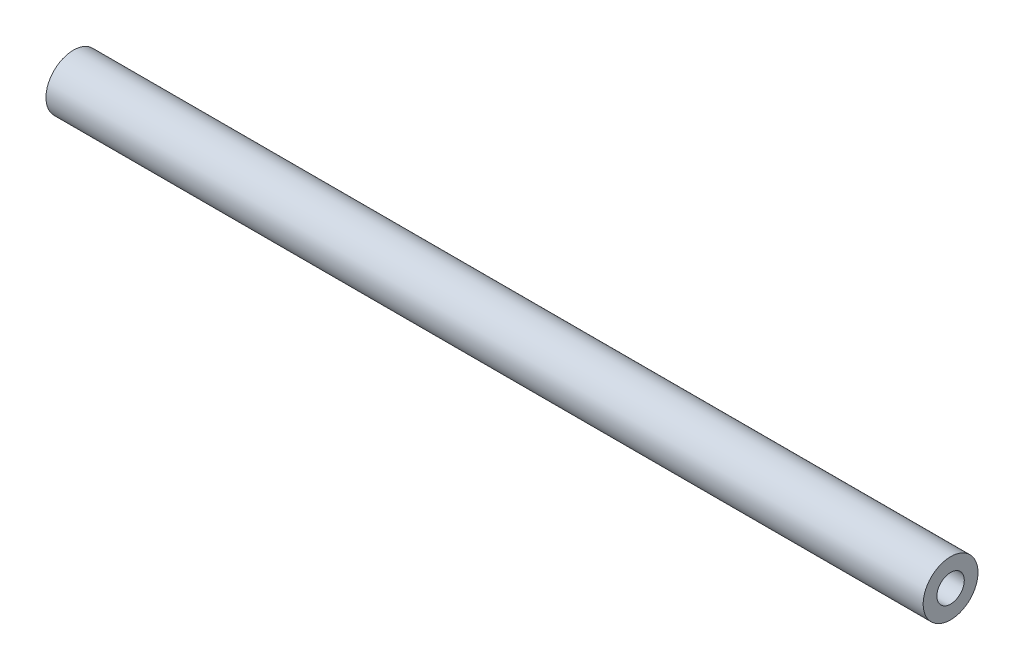
ISO-10303-21;
HEADER;
FILE_DESCRIPTION(('STEP AP214'),'2;1');
FILE_NAME('part.step','',(''),(''),'','','');
FILE_SCHEMA(('AUTOMOTIVE_DESIGN { 1 0 10303 214 1 1 1 1 }'));
ENDSEC;
DATA;
#1=APPLICATION_CONTEXT('core data for automotive mechanical design processes');
#2=APPLICATION_PROTOCOL_DEFINITION('international standard','automotive_design',2000,#1);
#3=PRODUCT_CONTEXT('',#1,'mechanical');
#4=PRODUCT('Part','Part','',(#3));
#5=PRODUCT_RELATED_PRODUCT_CATEGORY('part','',(#4));
#6=PRODUCT_DEFINITION_FORMATION('','',#4);
#7=PRODUCT_DEFINITION_CONTEXT('part definition',#1,'design');
#8=PRODUCT_DEFINITION('design','',#6,#7);
#9=PRODUCT_DEFINITION_SHAPE('','',#8);
#10=(LENGTH_UNIT() NAMED_UNIT(*) SI_UNIT(.MILLI.,.METRE.));
#11=(NAMED_UNIT(*) PLANE_ANGLE_UNIT() SI_UNIT($,.RADIAN.));
#12=(NAMED_UNIT(*) SI_UNIT($,.STERADIAN.) SOLID_ANGLE_UNIT());
#13=UNCERTAINTY_MEASURE_WITH_UNIT(LENGTH_MEASURE(1.E-05),#10,'distance_accuracy_value','');
#14=(GEOMETRIC_REPRESENTATION_CONTEXT(3) GLOBAL_UNCERTAINTY_ASSIGNED_CONTEXT((#13)) GLOBAL_UNIT_ASSIGNED_CONTEXT((#10,
#11,#12)) REPRESENTATION_CONTEXT('',''));
#15=CARTESIAN_POINT('',(0.,0.,0.));
#16=DIRECTION('',(0.,0.,1.));
#17=DIRECTION('',(1.,0.,0.));
#18=AXIS2_PLACEMENT_3D('',#15,#16,#17);
#19=CARTESIAN_POINT('',(203.2,0.,0.));
#20=DIRECTION('',(1.,0.,0.));
#21=DIRECTION('',(0.,0.,-1.));
#22=AXIS2_PLACEMENT_3D('',#19,#20,#21);
#23=PLANE('',#22);
#24=CARTESIAN_POINT('',(203.2,0.,0.));
#25=DIRECTION('',(1.,0.,0.));
#26=DIRECTION('',(0.,0.,-1.));
#27=AXIS2_PLACEMENT_3D('',#24,#25,#26);
#28=CIRCLE('',#27,6.35);
#29=CARTESIAN_POINT('',(203.2,0.,-6.35));
#30=VERTEX_POINT('',#29);
#31=EDGE_CURVE('E10',#30,#30,#28,.T.);
#32=ORIENTED_EDGE('',*,*,#31,.T.);
#33=EDGE_LOOP('',(#32));
#34=FACE_BOUND('',#33,.T.);
#35=CARTESIAN_POINT('',(203.2,0.,0.));
#36=DIRECTION('',(1.,0.,0.));
#37=DIRECTION('',(0.,0.,-1.));
#38=AXIS2_PLACEMENT_3D('',#35,#36,#37);
#39=CIRCLE('',#38,3.175);
#40=CARTESIAN_POINT('',(203.2,0.,-3.175));
#41=VERTEX_POINT('',#40);
#42=EDGE_CURVE('E41',#41,#41,#39,.T.);
#43=ORIENTED_EDGE('',*,*,#42,.F.);
#44=EDGE_LOOP('',(#43));
#45=FACE_BOUND('',#44,.T.);
#46=ADVANCED_FACE('F30',(#34,#45),#23,.T.);
#47=CARTESIAN_POINT('',(0.,0.,0.));
#48=DIRECTION('',(1.,0.,0.));
#49=DIRECTION('',(0.,0.,-1.));
#50=AXIS2_PLACEMENT_3D('',#47,#48,#49);
#51=PLANE('',#50);
#52=CARTESIAN_POINT('',(0.,0.,0.));
#53=DIRECTION('',(1.,0.,0.));
#54=DIRECTION('',(0.,0.,-1.));
#55=AXIS2_PLACEMENT_3D('',#52,#53,#54);
#56=CIRCLE('',#55,6.35);
#57=CARTESIAN_POINT('',(0.,0.,-6.35));
#58=VERTEX_POINT('',#57);
#59=EDGE_CURVE('E34',#58,#58,#56,.T.);
#60=ORIENTED_EDGE('',*,*,#59,.F.);
#61=EDGE_LOOP('',(#60));
#62=FACE_BOUND('',#61,.T.);
#63=CARTESIAN_POINT('',(0.,0.,0.));
#64=DIRECTION('',(1.,0.,0.));
#65=DIRECTION('',(0.,0.,-1.));
#66=AXIS2_PLACEMENT_3D('',#63,#64,#65);
#67=CIRCLE('',#66,3.175);
#68=CARTESIAN_POINT('',(0.,0.,-3.175));
#69=VERTEX_POINT('',#68);
#70=EDGE_CURVE('E43',#69,#69,#67,.T.);
#71=ORIENTED_EDGE('',*,*,#70,.T.);
#72=EDGE_LOOP('',(#71));
#73=FACE_BOUND('',#72,.T.);
#74=ADVANCED_FACE('F53',(#62,#73),#51,.F.);
#75=CARTESIAN_POINT('',(203.2,0.,0.));
#76=DIRECTION('',(-1.,0.,0.));
#77=DIRECTION('',(0.,0.,1.));
#78=AXIS2_PLACEMENT_3D('',#75,#76,#77);
#79=CYLINDRICAL_SURFACE('',#78,6.35);
#80=ORIENTED_EDGE('',*,*,#31,.F.);
#81=EDGE_LOOP('',(#80));
#82=FACE_BOUND('',#81,.T.);
#83=ORIENTED_EDGE('',*,*,#59,.T.);
#84=EDGE_LOOP('',(#83));
#85=FACE_BOUND('',#84,.T.);
#86=ADVANCED_FACE('F32',(#82,#85),#79,.T.);
#87=CARTESIAN_POINT('',(203.2,0.,0.));
#88=DIRECTION('',(-1.,0.,0.));
#89=DIRECTION('',(0.,0.,1.));
#90=AXIS2_PLACEMENT_3D('',#87,#88,#89);
#91=CYLINDRICAL_SURFACE('',#90,3.175);
#92=ORIENTED_EDGE('',*,*,#42,.T.);
#93=EDGE_LOOP('',(#92));
#94=FACE_BOUND('',#93,.T.);
#95=ORIENTED_EDGE('',*,*,#70,.F.);
#96=EDGE_LOOP('',(#95));
#97=FACE_BOUND('',#96,.T.);
#98=ADVANCED_FACE('F49',(#94,#97),#91,.F.);
#99=CLOSED_SHELL('',(#46,#74,#86,#98));
#100=MANIFOLD_SOLID_BREP('B2',#99);
#101=ADVANCED_BREP_SHAPE_REPRESENTATION('',(#18,#100),#14);
#102=SHAPE_DEFINITION_REPRESENTATION(#9,#101);
ENDSEC;
END-ISO-10303-21;
